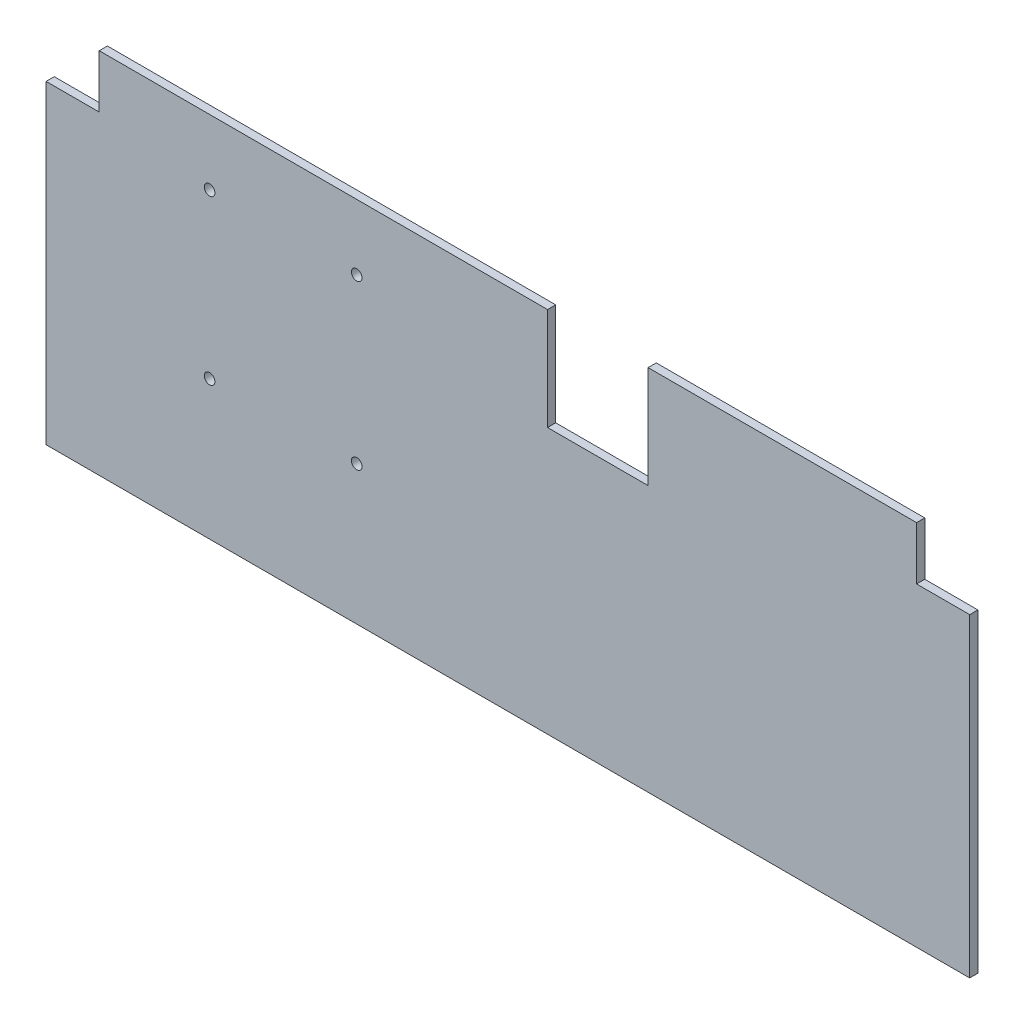
ISO-10303-21;
HEADER;
FILE_DESCRIPTION(('STEP AP214'),'2;1');
FILE_NAME('part.step','',(''),(''),'','','');
FILE_SCHEMA(('AUTOMOTIVE_DESIGN { 1 0 10303 214 1 1 1 1 }'));
ENDSEC;
DATA;
#1=APPLICATION_CONTEXT('core data for automotive mechanical design processes');
#2=APPLICATION_PROTOCOL_DEFINITION('international standard','automotive_design',2000,#1);
#3=PRODUCT_CONTEXT('',#1,'mechanical');
#4=PRODUCT('Part','Part','',(#3));
#5=PRODUCT_RELATED_PRODUCT_CATEGORY('part','',(#4));
#6=PRODUCT_DEFINITION_FORMATION('','',#4);
#7=PRODUCT_DEFINITION_CONTEXT('part definition',#1,'design');
#8=PRODUCT_DEFINITION('design','',#6,#7);
#9=PRODUCT_DEFINITION_SHAPE('','',#8);
#10=(LENGTH_UNIT() NAMED_UNIT(*) SI_UNIT(.MILLI.,.METRE.));
#11=(NAMED_UNIT(*) PLANE_ANGLE_UNIT() SI_UNIT($,.RADIAN.));
#12=(NAMED_UNIT(*) SI_UNIT($,.STERADIAN.) SOLID_ANGLE_UNIT());
#13=UNCERTAINTY_MEASURE_WITH_UNIT(LENGTH_MEASURE(1.E-05),#10,'distance_accuracy_value','');
#14=(GEOMETRIC_REPRESENTATION_CONTEXT(3) GLOBAL_UNCERTAINTY_ASSIGNED_CONTEXT((#13)) GLOBAL_UNIT_ASSIGNED_CONTEXT((#10,
#11,#12)) REPRESENTATION_CONTEXT('',''));
#15=CARTESIAN_POINT('',(0.,0.,0.));
#16=DIRECTION('',(0.,0.,1.));
#17=DIRECTION('',(1.,0.,0.));
#18=AXIS2_PLACEMENT_3D('',#15,#16,#17);
#19=CARTESIAN_POINT('',(-565.,200.,10.));
#20=DIRECTION('',(0.,-1.,0.));
#21=DIRECTION('',(1.,0.,0.));
#22=AXIS2_PLACEMENT_3D('',#19,#20,#21);
#23=PLANE('',#22);
#24=DIRECTION('',(-1.,0.,0.));
#25=VECTOR('',#24,1.);
#26=CARTESIAN_POINT('',(-565.,200.,10.));
#27=LINE('',#26,#25);
#28=CARTESIAN_POINT('',(48.5000000000002,200.,10.));
#29=VERTEX_POINT('',#28);
#30=CARTESIAN_POINT('',(-500.,200.,10.));
#31=VERTEX_POINT('',#30);
#32=EDGE_CURVE('E205',#29,#31,#27,.T.);
#33=ORIENTED_EDGE('',*,*,#32,.F.);
#34=DIRECTION('',(0.,0.,1.));
#35=VECTOR('',#34,1.);
#36=CARTESIAN_POINT('',(48.5000000000002,200.,0.));
#37=LINE('',#36,#35);
#38=CARTESIAN_POINT('',(48.5000000000002,200.,0.));
#39=VERTEX_POINT('',#38);
#40=EDGE_CURVE('E156',#39,#29,#37,.T.);
#41=ORIENTED_EDGE('',*,*,#40,.F.);
#42=DIRECTION('',(-1.,0.,0.));
#43=VECTOR('',#42,1.);
#44=CARTESIAN_POINT('',(-565.,200.,0.));
#45=LINE('',#44,#43);
#46=CARTESIAN_POINT('',(-500.,200.,0.));
#47=VERTEX_POINT('',#46);
#48=EDGE_CURVE('E144',#39,#47,#45,.T.);
#49=ORIENTED_EDGE('',*,*,#48,.T.);
#50=DIRECTION('',(0.,0.,1.));
#51=VECTOR('',#50,1.);
#52=CARTESIAN_POINT('',(-500.,200.,0.));
#53=LINE('',#52,#51);
#54=EDGE_CURVE('E190',#47,#31,#53,.T.);
#55=ORIENTED_EDGE('',*,*,#54,.T.);
#56=EDGE_LOOP('',(#33,#41,#49,#55));
#57=FACE_BOUND('',#56,.T.);
#58=ADVANCED_FACE('F35',(#57),#23,.F.);
#59=CARTESIAN_POINT('',(565.,200.,10.));
#60=DIRECTION('',(-1.,0.,0.));
#61=DIRECTION('',(0.,-1.,0.));
#62=AXIS2_PLACEMENT_3D('',#59,#60,#61);
#63=PLANE('',#62);
#64=DIRECTION('',(0.,0.,1.));
#65=VECTOR('',#64,1.);
#66=CARTESIAN_POINT('',(565.,135.,0.));
#67=LINE('',#66,#65);
#68=CARTESIAN_POINT('',(565.,135.,0.));
#69=VERTEX_POINT('',#68);
#70=CARTESIAN_POINT('',(565.,135.,10.));
#71=VERTEX_POINT('',#70);
#72=EDGE_CURVE('E173',#69,#71,#67,.T.);
#73=ORIENTED_EDGE('',*,*,#72,.T.);
#74=DIRECTION('',(0.,1.,0.));
#75=VECTOR('',#74,1.);
#76=CARTESIAN_POINT('',(565.,200.,10.));
#77=LINE('',#76,#75);
#78=CARTESIAN_POINT('',(565.,-250.,10.));
#79=VERTEX_POINT('',#78);
#80=EDGE_CURVE('E202',#79,#71,#77,.T.);
#81=ORIENTED_EDGE('',*,*,#80,.F.);
#82=DIRECTION('',(0.,0.,-1.));
#83=VECTOR('',#82,1.);
#84=CARTESIAN_POINT('',(565.,-250.,10.));
#85=LINE('',#84,#83);
#86=CARTESIAN_POINT('',(565.,-250.,0.));
#87=VERTEX_POINT('',#86);
#88=EDGE_CURVE('E43',#79,#87,#85,.T.);
#89=ORIENTED_EDGE('',*,*,#88,.T.);
#90=DIRECTION('',(0.,1.,0.));
#91=VECTOR('',#90,1.);
#92=CARTESIAN_POINT('',(565.,200.,0.));
#93=LINE('',#92,#91);
#94=EDGE_CURVE('E212',#87,#69,#93,.T.);
#95=ORIENTED_EDGE('',*,*,#94,.T.);
#96=EDGE_LOOP('',(#73,#81,#89,#95));
#97=FACE_BOUND('',#96,.T.);
#98=ADVANCED_FACE('F221',(#97),#63,.F.);
#99=CARTESIAN_POINT('',(500.,200.,0.));
#100=VERTEX_POINT('',#99);
#101=CARTESIAN_POINT('',(171.5,200.,0.));
#102=VERTEX_POINT('',#101);
#103=EDGE_CURVE('E200',#100,#102,#45,.T.);
#104=ORIENTED_EDGE('',*,*,#103,.T.);
#105=DIRECTION('',(0.,0.,1.));
#106=VECTOR('',#105,1.);
#107=CARTESIAN_POINT('',(171.5,200.,0.));
#108=LINE('',#107,#106);
#109=CARTESIAN_POINT('',(171.5,200.,10.));
#110=VERTEX_POINT('',#109);
#111=EDGE_CURVE('E159',#102,#110,#108,.T.);
#112=ORIENTED_EDGE('',*,*,#111,.T.);
#113=CARTESIAN_POINT('',(500.,200.,10.));
#114=VERTEX_POINT('',#113);
#115=EDGE_CURVE('E206',#114,#110,#27,.T.);
#116=ORIENTED_EDGE('',*,*,#115,.F.);
#117=DIRECTION('',(0.,0.,1.));
#118=VECTOR('',#117,1.);
#119=CARTESIAN_POINT('',(500.,200.,0.));
#120=LINE('',#119,#118);
#121=EDGE_CURVE('E168',#100,#114,#120,.T.);
#122=ORIENTED_EDGE('',*,*,#121,.F.);
#123=EDGE_LOOP('',(#104,#112,#116,#122));
#124=FACE_BOUND('',#123,.T.);
#125=ADVANCED_FACE('F252',(#124),#23,.F.);
#126=CARTESIAN_POINT('',(0.,0.,10.));
#127=DIRECTION('',(0.,0.,1.));
#128=DIRECTION('',(1.,0.,0.));
#129=AXIS2_PLACEMENT_3D('',#126,#127,#128);
#130=PLANE('',#129);
#131=CARTESIAN_POINT('',(-365.,120.,10.));
#132=DIRECTION('',(0.,0.,1.));
#133=DIRECTION('',(1.,0.,0.));
#134=AXIS2_PLACEMENT_3D('',#131,#132,#133);
#135=CIRCLE('',#134,6.50000000000001);
#136=CARTESIAN_POINT('',(-358.5,120.,10.));
#137=VERTEX_POINT('',#136);
#138=EDGE_CURVE('E413',#137,#137,#135,.T.);
#139=ORIENTED_EDGE('',*,*,#138,.F.);
#140=EDGE_LOOP('',(#139));
#141=FACE_BOUND('',#140,.T.);
#142=CARTESIAN_POINT('',(-185.,120.,10.));
#143=DIRECTION('',(0.,0.,1.));
#144=DIRECTION('',(1.,0.,0.));
#145=AXIS2_PLACEMENT_3D('',#142,#143,#144);
#146=CIRCLE('',#145,6.49999999999998);
#147=CARTESIAN_POINT('',(-178.5,120.,10.));
#148=VERTEX_POINT('',#147);
#149=EDGE_CURVE('E415',#148,#148,#146,.T.);
#150=ORIENTED_EDGE('',*,*,#149,.F.);
#151=EDGE_LOOP('',(#150));
#152=FACE_BOUND('',#151,.T.);
#153=CARTESIAN_POINT('',(-185.,-80.,10.));
#154=DIRECTION('',(0.,0.,1.));
#155=DIRECTION('',(1.,0.,0.));
#156=AXIS2_PLACEMENT_3D('',#153,#154,#155);
#157=CIRCLE('',#156,6.49999999999998);
#158=CARTESIAN_POINT('',(-178.5,-80.,10.));
#159=VERTEX_POINT('',#158);
#160=EDGE_CURVE('E423',#159,#159,#157,.T.);
#161=ORIENTED_EDGE('',*,*,#160,.F.);
#162=EDGE_LOOP('',(#161));
#163=FACE_BOUND('',#162,.T.);
#164=CARTESIAN_POINT('',(-365.,-80.,10.));
#165=DIRECTION('',(0.,0.,1.));
#166=DIRECTION('',(1.,0.,0.));
#167=AXIS2_PLACEMENT_3D('',#164,#165,#166);
#168=CIRCLE('',#167,6.50000000000001);
#169=CARTESIAN_POINT('',(-358.5,-80.,10.));
#170=VERTEX_POINT('',#169);
#171=EDGE_CURVE('E428',#170,#170,#168,.T.);
#172=ORIENTED_EDGE('',*,*,#171,.F.);
#173=EDGE_LOOP('',(#172));
#174=FACE_BOUND('',#173,.T.);
#175=DIRECTION('',(0.,-1.,0.));
#176=VECTOR('',#175,1.);
#177=CARTESIAN_POINT('',(48.5000000000002,200.,10.));
#178=LINE('',#177,#176);
#179=CARTESIAN_POINT('',(48.5000000000002,75.,10.));
#180=VERTEX_POINT('',#179);
#181=EDGE_CURVE('E130',#29,#180,#178,.T.);
#182=ORIENTED_EDGE('',*,*,#181,.F.);
#183=ORIENTED_EDGE('',*,*,#32,.T.);
#184=DIRECTION('',(0.,1.,0.));
#185=VECTOR('',#184,1.);
#186=CARTESIAN_POINT('',(-500.,200.,10.));
#187=LINE('',#186,#185);
#188=CARTESIAN_POINT('',(-500.,135.,10.));
#189=VERTEX_POINT('',#188);
#190=EDGE_CURVE('E183',#189,#31,#187,.T.);
#191=ORIENTED_EDGE('',*,*,#190,.F.);
#192=DIRECTION('',(1.,0.,0.));
#193=VECTOR('',#192,1.);
#194=CARTESIAN_POINT('',(-565.,135.,10.));
#195=LINE('',#194,#193);
#196=CARTESIAN_POINT('',(-565.,135.,10.));
#197=VERTEX_POINT('',#196);
#198=EDGE_CURVE('E176',#197,#189,#195,.T.);
#199=ORIENTED_EDGE('',*,*,#198,.F.);
#200=DIRECTION('',(0.,-1.,0.));
#201=VECTOR('',#200,1.);
#202=CARTESIAN_POINT('',(-565.,200.,10.));
#203=LINE('',#202,#201);
#204=CARTESIAN_POINT('',(-565.,-250.,10.));
#205=VERTEX_POINT('',#204);
#206=EDGE_CURVE('E197',#197,#205,#203,.T.);
#207=ORIENTED_EDGE('',*,*,#206,.T.);
#208=DIRECTION('',(1.,0.,0.));
#209=VECTOR('',#208,1.);
#210=CARTESIAN_POINT('',(-565.,-250.,10.));
#211=LINE('',#210,#209);
#212=EDGE_CURVE('E199',#205,#79,#211,.T.);
#213=ORIENTED_EDGE('',*,*,#212,.T.);
#214=ORIENTED_EDGE('',*,*,#80,.T.);
#215=DIRECTION('',(-1.,0.,0.));
#216=VECTOR('',#215,1.);
#217=CARTESIAN_POINT('',(565.,135.,10.));
#218=LINE('',#217,#216);
#219=CARTESIAN_POINT('',(500.,135.,10.));
#220=VERTEX_POINT('',#219);
#221=EDGE_CURVE('E166',#71,#220,#218,.T.);
#222=ORIENTED_EDGE('',*,*,#221,.T.);
#223=DIRECTION('',(0.,1.,0.));
#224=VECTOR('',#223,1.);
#225=CARTESIAN_POINT('',(500.,200.,10.));
#226=LINE('',#225,#224);
#227=EDGE_CURVE('E158',#220,#114,#226,.T.);
#228=ORIENTED_EDGE('',*,*,#227,.T.);
#229=ORIENTED_EDGE('',*,*,#115,.T.);
#230=DIRECTION('',(0.,1.,0.));
#231=VECTOR('',#230,1.);
#232=CARTESIAN_POINT('',(171.5,200.,10.));
#233=LINE('',#232,#231);
#234=CARTESIAN_POINT('',(171.5,75.,10.));
#235=VERTEX_POINT('',#234);
#236=EDGE_CURVE('E145',#235,#110,#233,.T.);
#237=ORIENTED_EDGE('',*,*,#236,.F.);
#238=DIRECTION('',(1.,0.,0.));
#239=VECTOR('',#238,1.);
#240=CARTESIAN_POINT('',(48.5000000000002,75.,10.));
#241=LINE('',#240,#239);
#242=EDGE_CURVE('E147',#180,#235,#241,.T.);
#243=ORIENTED_EDGE('',*,*,#242,.F.);
#244=EDGE_LOOP('',(#182,#183,#191,#199,#207,#213,#214,#222,#228,#229,#237,#243));
#245=FACE_BOUND('',#244,.T.);
#246=ADVANCED_FACE('F232',(#141,#152,#163,#174,#245),#130,.T.);
#247=CARTESIAN_POINT('',(0.,0.,0.));
#248=DIRECTION('',(0.,0.,1.));
#249=DIRECTION('',(1.,0.,0.));
#250=AXIS2_PLACEMENT_3D('',#247,#248,#249);
#251=PLANE('',#250);
#252=CARTESIAN_POINT('',(-365.,120.,0.));
#253=DIRECTION('',(0.,0.,1.));
#254=DIRECTION('',(1.,0.,0.));
#255=AXIS2_PLACEMENT_3D('',#252,#253,#254);
#256=CIRCLE('',#255,6.49999999999995);
#257=CARTESIAN_POINT('',(-358.5,120.,0.));
#258=VERTEX_POINT('',#257);
#259=EDGE_CURVE('E411',#258,#258,#256,.T.);
#260=ORIENTED_EDGE('',*,*,#259,.T.);
#261=EDGE_LOOP('',(#260));
#262=FACE_BOUND('',#261,.T.);
#263=CARTESIAN_POINT('',(-185.,120.,0.));
#264=DIRECTION('',(0.,0.,1.));
#265=DIRECTION('',(1.,0.,0.));
#266=AXIS2_PLACEMENT_3D('',#263,#264,#265);
#267=CIRCLE('',#266,6.49999999999995);
#268=CARTESIAN_POINT('',(-178.5,120.,0.));
#269=VERTEX_POINT('',#268);
#270=EDGE_CURVE('E420',#269,#269,#267,.T.);
#271=ORIENTED_EDGE('',*,*,#270,.T.);
#272=EDGE_LOOP('',(#271));
#273=FACE_BOUND('',#272,.T.);
#274=CARTESIAN_POINT('',(-185.,-80.,0.));
#275=DIRECTION('',(0.,0.,1.));
#276=DIRECTION('',(1.,0.,0.));
#277=AXIS2_PLACEMENT_3D('',#274,#275,#276);
#278=CIRCLE('',#277,6.49999999999995);
#279=CARTESIAN_POINT('',(-178.5,-80.,0.));
#280=VERTEX_POINT('',#279);
#281=EDGE_CURVE('E426',#280,#280,#278,.T.);
#282=ORIENTED_EDGE('',*,*,#281,.T.);
#283=EDGE_LOOP('',(#282));
#284=FACE_BOUND('',#283,.T.);
#285=CARTESIAN_POINT('',(-365.,-80.,0.));
#286=DIRECTION('',(0.,0.,1.));
#287=DIRECTION('',(1.,0.,0.));
#288=AXIS2_PLACEMENT_3D('',#285,#286,#287);
#289=CIRCLE('',#288,6.49999999999995);
#290=CARTESIAN_POINT('',(-358.5,-80.,0.));
#291=VERTEX_POINT('',#290);
#292=EDGE_CURVE('E150',#291,#291,#289,.T.);
#293=ORIENTED_EDGE('',*,*,#292,.T.);
#294=EDGE_LOOP('',(#293));
#295=FACE_BOUND('',#294,.T.);
#296=ORIENTED_EDGE('',*,*,#48,.F.);
#297=DIRECTION('',(0.,-1.,0.));
#298=VECTOR('',#297,1.);
#299=CARTESIAN_POINT('',(48.5000000000002,200.,0.));
#300=LINE('',#299,#298);
#301=CARTESIAN_POINT('',(48.5000000000002,75.,0.));
#302=VERTEX_POINT('',#301);
#303=EDGE_CURVE('E127',#39,#302,#300,.T.);
#304=ORIENTED_EDGE('',*,*,#303,.T.);
#305=DIRECTION('',(1.,0.,0.));
#306=VECTOR('',#305,1.);
#307=CARTESIAN_POINT('',(48.5000000000002,75.,0.));
#308=LINE('',#307,#306);
#309=CARTESIAN_POINT('',(171.5,75.,0.));
#310=VERTEX_POINT('',#309);
#311=EDGE_CURVE('E137',#302,#310,#308,.T.);
#312=ORIENTED_EDGE('',*,*,#311,.T.);
#313=DIRECTION('',(0.,1.,0.));
#314=VECTOR('',#313,1.);
#315=CARTESIAN_POINT('',(171.5,200.,0.));
#316=LINE('',#315,#314);
#317=EDGE_CURVE('E50',#310,#102,#316,.T.);
#318=ORIENTED_EDGE('',*,*,#317,.T.);
#319=ORIENTED_EDGE('',*,*,#103,.F.);
#320=DIRECTION('',(0.,1.,0.));
#321=VECTOR('',#320,1.);
#322=CARTESIAN_POINT('',(500.,200.,0.));
#323=LINE('',#322,#321);
#324=CARTESIAN_POINT('',(500.,135.,0.));
#325=VERTEX_POINT('',#324);
#326=EDGE_CURVE('E163',#325,#100,#323,.T.);
#327=ORIENTED_EDGE('',*,*,#326,.F.);
#328=DIRECTION('',(-1.,0.,0.));
#329=VECTOR('',#328,1.);
#330=CARTESIAN_POINT('',(565.,135.,0.));
#331=LINE('',#330,#329);
#332=EDGE_CURVE('E165',#69,#325,#331,.T.);
#333=ORIENTED_EDGE('',*,*,#332,.F.);
#334=ORIENTED_EDGE('',*,*,#94,.F.);
#335=DIRECTION('',(1.,0.,0.));
#336=VECTOR('',#335,1.);
#337=CARTESIAN_POINT('',(-565.,-250.,0.));
#338=LINE('',#337,#336);
#339=CARTESIAN_POINT('',(-565.,-250.,0.));
#340=VERTEX_POINT('',#339);
#341=EDGE_CURVE('E210',#340,#87,#338,.T.);
#342=ORIENTED_EDGE('',*,*,#341,.F.);
#343=DIRECTION('',(0.,-1.,0.));
#344=VECTOR('',#343,1.);
#345=CARTESIAN_POINT('',(-565.,200.,0.));
#346=LINE('',#345,#344);
#347=CARTESIAN_POINT('',(-565.,135.,0.));
#348=VERTEX_POINT('',#347);
#349=EDGE_CURVE('E193',#348,#340,#346,.T.);
#350=ORIENTED_EDGE('',*,*,#349,.F.);
#351=DIRECTION('',(1.,0.,0.));
#352=VECTOR('',#351,1.);
#353=CARTESIAN_POINT('',(-565.,135.,0.));
#354=LINE('',#353,#352);
#355=CARTESIAN_POINT('',(-500.,135.,0.));
#356=VERTEX_POINT('',#355);
#357=EDGE_CURVE('E179',#348,#356,#354,.T.);
#358=ORIENTED_EDGE('',*,*,#357,.T.);
#359=DIRECTION('',(0.,1.,0.));
#360=VECTOR('',#359,1.);
#361=CARTESIAN_POINT('',(-500.,200.,0.));
#362=LINE('',#361,#360);
#363=EDGE_CURVE('E182',#356,#47,#362,.T.);
#364=ORIENTED_EDGE('',*,*,#363,.T.);
#365=EDGE_LOOP('',(#296,#304,#312,#318,#319,#327,#333,#334,#342,#350,#358,#364));
#366=FACE_BOUND('',#365,.T.);
#367=ADVANCED_FACE('F142',(#262,#273,#284,#295,#366),#251,.F.);
#368=CARTESIAN_POINT('',(-565.,200.,10.));
#369=DIRECTION('',(1.,0.,0.));
#370=DIRECTION('',(0.,0.,-1.));
#371=AXIS2_PLACEMENT_3D('',#368,#369,#370);
#372=PLANE('',#371);
#373=ORIENTED_EDGE('',*,*,#206,.F.);
#374=DIRECTION('',(0.,0.,1.));
#375=VECTOR('',#374,1.);
#376=CARTESIAN_POINT('',(-565.,135.,0.));
#377=LINE('',#376,#375);
#378=EDGE_CURVE('E185',#348,#197,#377,.T.);
#379=ORIENTED_EDGE('',*,*,#378,.F.);
#380=ORIENTED_EDGE('',*,*,#349,.T.);
#381=DIRECTION('',(0.,0.,-1.));
#382=VECTOR('',#381,1.);
#383=CARTESIAN_POINT('',(-565.,-250.,10.));
#384=LINE('',#383,#382);
#385=EDGE_CURVE('E11',#205,#340,#384,.T.);
#386=ORIENTED_EDGE('',*,*,#385,.F.);
#387=EDGE_LOOP('',(#373,#379,#380,#386));
#388=FACE_BOUND('',#387,.T.);
#389=ADVANCED_FACE('F37',(#388),#372,.F.);
#390=CARTESIAN_POINT('',(-565.,-250.,10.));
#391=DIRECTION('',(0.,1.,0.));
#392=DIRECTION('',(-1.,0.,0.));
#393=AXIS2_PLACEMENT_3D('',#390,#391,#392);
#394=PLANE('',#393);
#395=ORIENTED_EDGE('',*,*,#341,.T.);
#396=ORIENTED_EDGE('',*,*,#88,.F.);
#397=ORIENTED_EDGE('',*,*,#212,.F.);
#398=ORIENTED_EDGE('',*,*,#385,.T.);
#399=EDGE_LOOP('',(#395,#396,#397,#398));
#400=FACE_BOUND('',#399,.T.);
#401=ADVANCED_FACE('F236',(#400),#394,.F.);
#402=CARTESIAN_POINT('',(-500.,200.,0.));
#403=DIRECTION('',(1.,0.,0.));
#404=DIRECTION('',(0.,0.,-1.));
#405=AXIS2_PLACEMENT_3D('',#402,#403,#404);
#406=PLANE('',#405);
#407=ORIENTED_EDGE('',*,*,#190,.T.);
#408=ORIENTED_EDGE('',*,*,#54,.F.);
#409=ORIENTED_EDGE('',*,*,#363,.F.);
#410=DIRECTION('',(0.,0.,1.));
#411=VECTOR('',#410,1.);
#412=CARTESIAN_POINT('',(-500.,135.,0.));
#413=LINE('',#412,#411);
#414=EDGE_CURVE('E194',#356,#189,#413,.T.);
#415=ORIENTED_EDGE('',*,*,#414,.T.);
#416=EDGE_LOOP('',(#407,#408,#409,#415));
#417=FACE_BOUND('',#416,.T.);
#418=ADVANCED_FACE('F244',(#417),#406,.F.);
#419=CARTESIAN_POINT('',(-565.,135.,0.));
#420=DIRECTION('',(0.,-1.,0.));
#421=DIRECTION('',(0.,0.,-1.));
#422=AXIS2_PLACEMENT_3D('',#419,#420,#421);
#423=PLANE('',#422);
#424=ORIENTED_EDGE('',*,*,#198,.T.);
#425=ORIENTED_EDGE('',*,*,#414,.F.);
#426=ORIENTED_EDGE('',*,*,#357,.F.);
#427=ORIENTED_EDGE('',*,*,#378,.T.);
#428=EDGE_LOOP('',(#424,#425,#426,#427));
#429=FACE_BOUND('',#428,.T.);
#430=ADVANCED_FACE('F241',(#429),#423,.F.);
#431=CARTESIAN_POINT('',(565.,135.,0.));
#432=DIRECTION('',(0.,1.,0.));
#433=DIRECTION('',(0.,0.,1.));
#434=AXIS2_PLACEMENT_3D('',#431,#432,#433);
#435=PLANE('',#434);
#436=ORIENTED_EDGE('',*,*,#221,.F.);
#437=ORIENTED_EDGE('',*,*,#72,.F.);
#438=ORIENTED_EDGE('',*,*,#332,.T.);
#439=DIRECTION('',(0.,0.,1.));
#440=VECTOR('',#439,1.);
#441=CARTESIAN_POINT('',(500.,135.,0.));
#442=LINE('',#441,#440);
#443=EDGE_CURVE('E58',#325,#220,#442,.T.);
#444=ORIENTED_EDGE('',*,*,#443,.T.);
#445=EDGE_LOOP('',(#436,#437,#438,#444));
#446=FACE_BOUND('',#445,.T.);
#447=ADVANCED_FACE('F230',(#446),#435,.T.);
#448=CARTESIAN_POINT('',(500.,200.,0.));
#449=DIRECTION('',(1.,0.,0.));
#450=DIRECTION('',(0.,0.,-1.));
#451=AXIS2_PLACEMENT_3D('',#448,#449,#450);
#452=PLANE('',#451);
#453=ORIENTED_EDGE('',*,*,#227,.F.);
#454=ORIENTED_EDGE('',*,*,#443,.F.);
#455=ORIENTED_EDGE('',*,*,#326,.T.);
#456=ORIENTED_EDGE('',*,*,#121,.T.);
#457=EDGE_LOOP('',(#453,#454,#455,#456));
#458=FACE_BOUND('',#457,.T.);
#459=ADVANCED_FACE('F254',(#458),#452,.T.);
#460=CARTESIAN_POINT('',(48.5000000000002,200.,0.));
#461=DIRECTION('',(-1.,0.,0.));
#462=DIRECTION('',(0.,-1.,0.));
#463=AXIS2_PLACEMENT_3D('',#460,#461,#462);
#464=PLANE('',#463);
#465=ORIENTED_EDGE('',*,*,#181,.T.);
#466=DIRECTION('',(0.,0.,1.));
#467=VECTOR('',#466,1.);
#468=CARTESIAN_POINT('',(48.5000000000002,75.,0.));
#469=LINE('',#468,#467);
#470=EDGE_CURVE('E123',#302,#180,#469,.T.);
#471=ORIENTED_EDGE('',*,*,#470,.F.);
#472=ORIENTED_EDGE('',*,*,#303,.F.);
#473=ORIENTED_EDGE('',*,*,#40,.T.);
#474=EDGE_LOOP('',(#465,#471,#472,#473));
#475=FACE_BOUND('',#474,.T.);
#476=ADVANCED_FACE('F125',(#475),#464,.F.);
#477=CARTESIAN_POINT('',(171.5,200.,0.));
#478=DIRECTION('',(1.,0.,0.));
#479=DIRECTION('',(0.,0.,-1.));
#480=AXIS2_PLACEMENT_3D('',#477,#478,#479);
#481=PLANE('',#480);
#482=ORIENTED_EDGE('',*,*,#236,.T.);
#483=ORIENTED_EDGE('',*,*,#111,.F.);
#484=ORIENTED_EDGE('',*,*,#317,.F.);
#485=DIRECTION('',(0.,0.,1.));
#486=VECTOR('',#485,1.);
#487=CARTESIAN_POINT('',(171.5,75.,0.));
#488=LINE('',#487,#486);
#489=EDGE_CURVE('E134',#310,#235,#488,.T.);
#490=ORIENTED_EDGE('',*,*,#489,.T.);
#491=EDGE_LOOP('',(#482,#483,#484,#490));
#492=FACE_BOUND('',#491,.T.);
#493=ADVANCED_FACE('F250',(#492),#481,.F.);
#494=CARTESIAN_POINT('',(48.5000000000002,75.,0.));
#495=DIRECTION('',(0.,-1.,0.));
#496=DIRECTION('',(1.,0.,0.));
#497=AXIS2_PLACEMENT_3D('',#494,#495,#496);
#498=PLANE('',#497);
#499=ORIENTED_EDGE('',*,*,#242,.T.);
#500=ORIENTED_EDGE('',*,*,#489,.F.);
#501=ORIENTED_EDGE('',*,*,#311,.F.);
#502=ORIENTED_EDGE('',*,*,#470,.T.);
#503=EDGE_LOOP('',(#499,#500,#501,#502));
#504=FACE_BOUND('',#503,.T.);
#505=ADVANCED_FACE('F138',(#504),#498,.F.);
#506=CARTESIAN_POINT('',(-365.,-80.,10.));
#507=DIRECTION('',(0.,0.,1.));
#508=DIRECTION('',(1.,0.,0.));
#509=AXIS2_PLACEMENT_3D('',#506,#507,#508);
#510=CYLINDRICAL_SURFACE('',#509,6.49999999999998);
#511=ORIENTED_EDGE('',*,*,#292,.F.);
#512=EDGE_LOOP('',(#511));
#513=FACE_BOUND('',#512,.T.);
#514=ORIENTED_EDGE('',*,*,#171,.T.);
#515=EDGE_LOOP('',(#514));
#516=FACE_BOUND('',#515,.T.);
#517=ADVANCED_FACE('F307',(#513,#516),#510,.F.);
#518=CARTESIAN_POINT('',(-185.,-80.,10.));
#519=DIRECTION('',(0.,0.,1.));
#520=DIRECTION('',(1.,0.,0.));
#521=AXIS2_PLACEMENT_3D('',#518,#519,#520);
#522=CYLINDRICAL_SURFACE('',#521,6.49999999999996);
#523=ORIENTED_EDGE('',*,*,#281,.F.);
#524=EDGE_LOOP('',(#523));
#525=FACE_BOUND('',#524,.T.);
#526=ORIENTED_EDGE('',*,*,#160,.T.);
#527=EDGE_LOOP('',(#526));
#528=FACE_BOUND('',#527,.T.);
#529=ADVANCED_FACE('F312',(#525,#528),#522,.F.);
#530=CARTESIAN_POINT('',(-185.,120.,10.));
#531=DIRECTION('',(0.,0.,1.));
#532=DIRECTION('',(1.,0.,0.));
#533=AXIS2_PLACEMENT_3D('',#530,#531,#532);
#534=CYLINDRICAL_SURFACE('',#533,6.49999999999996);
#535=ORIENTED_EDGE('',*,*,#270,.F.);
#536=EDGE_LOOP('',(#535));
#537=FACE_BOUND('',#536,.T.);
#538=ORIENTED_EDGE('',*,*,#149,.T.);
#539=EDGE_LOOP('',(#538));
#540=FACE_BOUND('',#539,.T.);
#541=ADVANCED_FACE('F324',(#537,#540),#534,.F.);
#542=CARTESIAN_POINT('',(-365.,120.,10.));
#543=DIRECTION('',(0.,0.,1.));
#544=DIRECTION('',(1.,0.,0.));
#545=AXIS2_PLACEMENT_3D('',#542,#543,#544);
#546=CYLINDRICAL_SURFACE('',#545,6.49999999999998);
#547=ORIENTED_EDGE('',*,*,#259,.F.);
#548=EDGE_LOOP('',(#547));
#549=FACE_BOUND('',#548,.T.);
#550=ORIENTED_EDGE('',*,*,#138,.T.);
#551=EDGE_LOOP('',(#550));
#552=FACE_BOUND('',#551,.T.);
#553=ADVANCED_FACE('F334',(#549,#552),#546,.F.);
#554=CLOSED_SHELL('',(#58,#98,#125,#246,#367,#389,#401,#418,#430,#447,#459,#476,#493,#505,#517,
#529,#541,#553));
#555=MANIFOLD_SOLID_BREP('B2',#554);
#556=ADVANCED_BREP_SHAPE_REPRESENTATION('',(#18,#555),#14);
#557=SHAPE_DEFINITION_REPRESENTATION(#9,#556);
ENDSEC;
END-ISO-10303-21;
